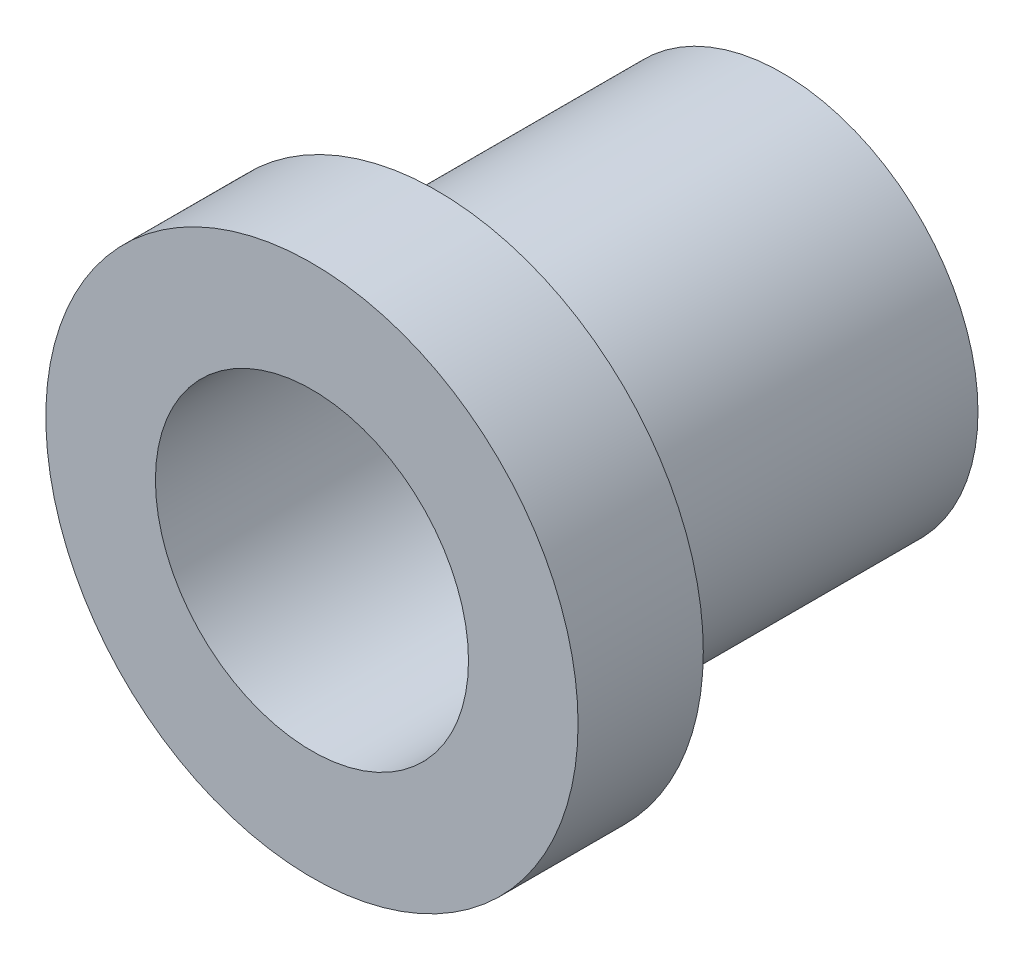
ISO-10303-21;
HEADER;
FILE_DESCRIPTION(('STEP AP214'),'2;1');
FILE_NAME('part.step','',(''),(''),'','','');
FILE_SCHEMA(('AUTOMOTIVE_DESIGN { 1 0 10303 214 1 1 1 1 }'));
ENDSEC;
DATA;
#1=APPLICATION_CONTEXT('core data for automotive mechanical design processes');
#2=APPLICATION_PROTOCOL_DEFINITION('international standard','automotive_design',2000,#1);
#3=PRODUCT_CONTEXT('',#1,'mechanical');
#4=PRODUCT('Part','Part','',(#3));
#5=PRODUCT_RELATED_PRODUCT_CATEGORY('part','',(#4));
#6=PRODUCT_DEFINITION_FORMATION('','',#4);
#7=PRODUCT_DEFINITION_CONTEXT('part definition',#1,'design');
#8=PRODUCT_DEFINITION('design','',#6,#7);
#9=PRODUCT_DEFINITION_SHAPE('','',#8);
#10=(LENGTH_UNIT() NAMED_UNIT(*) SI_UNIT(.MILLI.,.METRE.));
#11=(NAMED_UNIT(*) PLANE_ANGLE_UNIT() SI_UNIT($,.RADIAN.));
#12=(NAMED_UNIT(*) SI_UNIT($,.STERADIAN.) SOLID_ANGLE_UNIT());
#13=UNCERTAINTY_MEASURE_WITH_UNIT(LENGTH_MEASURE(1.E-05),#10,'distance_accuracy_value','');
#14=(GEOMETRIC_REPRESENTATION_CONTEXT(3) GLOBAL_UNCERTAINTY_ASSIGNED_CONTEXT((#13)) GLOBAL_UNIT_ASSIGNED_CONTEXT((#10,
#11,#12)) REPRESENTATION_CONTEXT('',''));
#15=CARTESIAN_POINT('',(0.,0.,0.));
#16=DIRECTION('',(0.,0.,1.));
#17=DIRECTION('',(1.,0.,0.));
#18=AXIS2_PLACEMENT_3D('',#15,#16,#17);
#19=CARTESIAN_POINT('',(0.,0.,0.));
#20=DIRECTION('',(0.,0.,1.));
#21=DIRECTION('',(1.,0.,0.));
#22=AXIS2_PLACEMENT_3D('',#19,#20,#21);
#23=PLANE('',#22);
#24=CARTESIAN_POINT('',(0.,0.,0.));
#25=DIRECTION('',(0.,0.,1.));
#26=DIRECTION('',(1.,0.,0.));
#27=AXIS2_PLACEMENT_3D('',#24,#25,#26);
#28=CIRCLE('',#27,5.3975);
#29=CARTESIAN_POINT('',(5.3975,0.,0.));
#30=VERTEX_POINT('',#29);
#31=EDGE_CURVE('E42',#30,#30,#28,.T.);
#32=ORIENTED_EDGE('',*,*,#31,.F.);
#33=EDGE_LOOP('',(#32));
#34=FACE_BOUND('',#33,.T.);
#35=CARTESIAN_POINT('',(0.,0.,0.));
#36=DIRECTION('',(0.,0.,1.));
#37=DIRECTION('',(1.,0.,0.));
#38=AXIS2_PLACEMENT_3D('',#35,#36,#37);
#39=CIRCLE('',#38,3.96875);
#40=CARTESIAN_POINT('',(3.96875,0.,0.));
#41=VERTEX_POINT('',#40);
#42=EDGE_CURVE('E10',#41,#41,#39,.F.);
#43=ORIENTED_EDGE('',*,*,#42,.F.);
#44=EDGE_LOOP('',(#43));
#45=FACE_BOUND('',#44,.T.);
#46=ADVANCED_FACE('F31',(#34,#45),#23,.F.);
#47=CARTESIAN_POINT('',(0.,0.,2.54));
#48=DIRECTION('',(0.,0.,1.));
#49=DIRECTION('',(1.,0.,0.));
#50=AXIS2_PLACEMENT_3D('',#47,#48,#49);
#51=PLANE('',#50);
#52=CARTESIAN_POINT('',(0.,0.,2.54));
#53=DIRECTION('',(0.,0.,1.));
#54=DIRECTION('',(1.,0.,0.));
#55=AXIS2_PLACEMENT_3D('',#52,#53,#54);
#56=CIRCLE('',#55,5.3975);
#57=CARTESIAN_POINT('',(5.3975,0.,2.54));
#58=VERTEX_POINT('',#57);
#59=EDGE_CURVE('E38',#58,#58,#56,.T.);
#60=ORIENTED_EDGE('',*,*,#59,.T.);
#61=EDGE_LOOP('',(#60));
#62=FACE_BOUND('',#61,.T.);
#63=CARTESIAN_POINT('',(0.,0.,2.54));
#64=DIRECTION('',(0.,0.,1.));
#65=DIRECTION('',(1.,0.,0.));
#66=AXIS2_PLACEMENT_3D('',#63,#64,#65);
#67=CIRCLE('',#66,3.175);
#68=CARTESIAN_POINT('',(3.175,0.,2.54));
#69=VERTEX_POINT('',#68);
#70=EDGE_CURVE('E47',#69,#69,#67,.T.);
#71=ORIENTED_EDGE('',*,*,#70,.F.);
#72=EDGE_LOOP('',(#71));
#73=FACE_BOUND('',#72,.T.);
#74=ADVANCED_FACE('F74',(#62,#73),#51,.T.);
#75=CARTESIAN_POINT('',(0.,0.,2.54));
#76=DIRECTION('',(0.,0.,-1.));
#77=DIRECTION('',(-1.,0.,0.));
#78=AXIS2_PLACEMENT_3D('',#75,#76,#77);
#79=CYLINDRICAL_SURFACE('',#78,5.3975);
#80=ORIENTED_EDGE('',*,*,#59,.F.);
#81=EDGE_LOOP('',(#80));
#82=FACE_BOUND('',#81,.T.);
#83=ORIENTED_EDGE('',*,*,#31,.T.);
#84=EDGE_LOOP('',(#83));
#85=FACE_BOUND('',#84,.T.);
#86=ADVANCED_FACE('F33',(#82,#85),#79,.T.);
#87=CARTESIAN_POINT('',(0.,0.,2.54));
#88=DIRECTION('',(0.,0.,-1.));
#89=DIRECTION('',(-1.,0.,0.));
#90=AXIS2_PLACEMENT_3D('',#87,#88,#89);
#91=CYLINDRICAL_SURFACE('',#90,3.175);
#92=ORIENTED_EDGE('',*,*,#70,.T.);
#93=EDGE_LOOP('',(#92));
#94=FACE_BOUND('',#93,.T.);
#95=CARTESIAN_POINT('',(0.,0.,-7.));
#96=DIRECTION('',(0.,0.,-1.));
#97=DIRECTION('',(-1.,0.,0.));
#98=AXIS2_PLACEMENT_3D('',#95,#96,#97);
#99=CIRCLE('',#98,3.175);
#100=CARTESIAN_POINT('',(-3.175,0.,-7.));
#101=VERTEX_POINT('',#100);
#102=EDGE_CURVE('E54',#101,#101,#99,.T.);
#103=ORIENTED_EDGE('',*,*,#102,.T.);
#104=EDGE_LOOP('',(#103));
#105=FACE_BOUND('',#104,.T.);
#106=ADVANCED_FACE('F58',(#94,#105),#91,.F.);
#107=CARTESIAN_POINT('',(0.,0.,-7.));
#108=DIRECTION('',(0.,0.,-1.));
#109=DIRECTION('',(-1.,0.,0.));
#110=AXIS2_PLACEMENT_3D('',#107,#108,#109);
#111=PLANE('',#110);
#112=CARTESIAN_POINT('',(0.,0.,-7.));
#113=DIRECTION('',(0.,0.,-1.));
#114=DIRECTION('',(-1.,0.,0.));
#115=AXIS2_PLACEMENT_3D('',#112,#113,#114);
#116=CIRCLE('',#115,3.96875);
#117=CARTESIAN_POINT('',(-3.96875,0.,-7.));
#118=VERTEX_POINT('',#117);
#119=EDGE_CURVE('E51',#118,#118,#116,.T.);
#120=ORIENTED_EDGE('',*,*,#119,.T.);
#121=EDGE_LOOP('',(#120));
#122=FACE_BOUND('',#121,.T.);
#123=ORIENTED_EDGE('',*,*,#102,.F.);
#124=EDGE_LOOP('',(#123));
#125=FACE_BOUND('',#124,.T.);
#126=ADVANCED_FACE('F60',(#122,#125),#111,.T.);
#127=CARTESIAN_POINT('',(0.,0.,-7.));
#128=DIRECTION('',(0.,0.,1.));
#129=DIRECTION('',(1.,0.,0.));
#130=AXIS2_PLACEMENT_3D('',#127,#128,#129);
#131=CYLINDRICAL_SURFACE('',#130,3.96875);
#132=ORIENTED_EDGE('',*,*,#119,.F.);
#133=EDGE_LOOP('',(#132));
#134=FACE_BOUND('',#133,.T.);
#135=ORIENTED_EDGE('',*,*,#42,.T.);
#136=EDGE_LOOP('',(#135));
#137=FACE_BOUND('',#136,.T.);
#138=ADVANCED_FACE('F62',(#134,#137),#131,.T.);
#139=CLOSED_SHELL('',(#46,#74,#86,#106,#126,#138));
#140=MANIFOLD_SOLID_BREP('B2',#139);
#141=ADVANCED_BREP_SHAPE_REPRESENTATION('',(#18,#140),#14);
#142=SHAPE_DEFINITION_REPRESENTATION(#9,#141);
ENDSEC;
END-ISO-10303-21;
